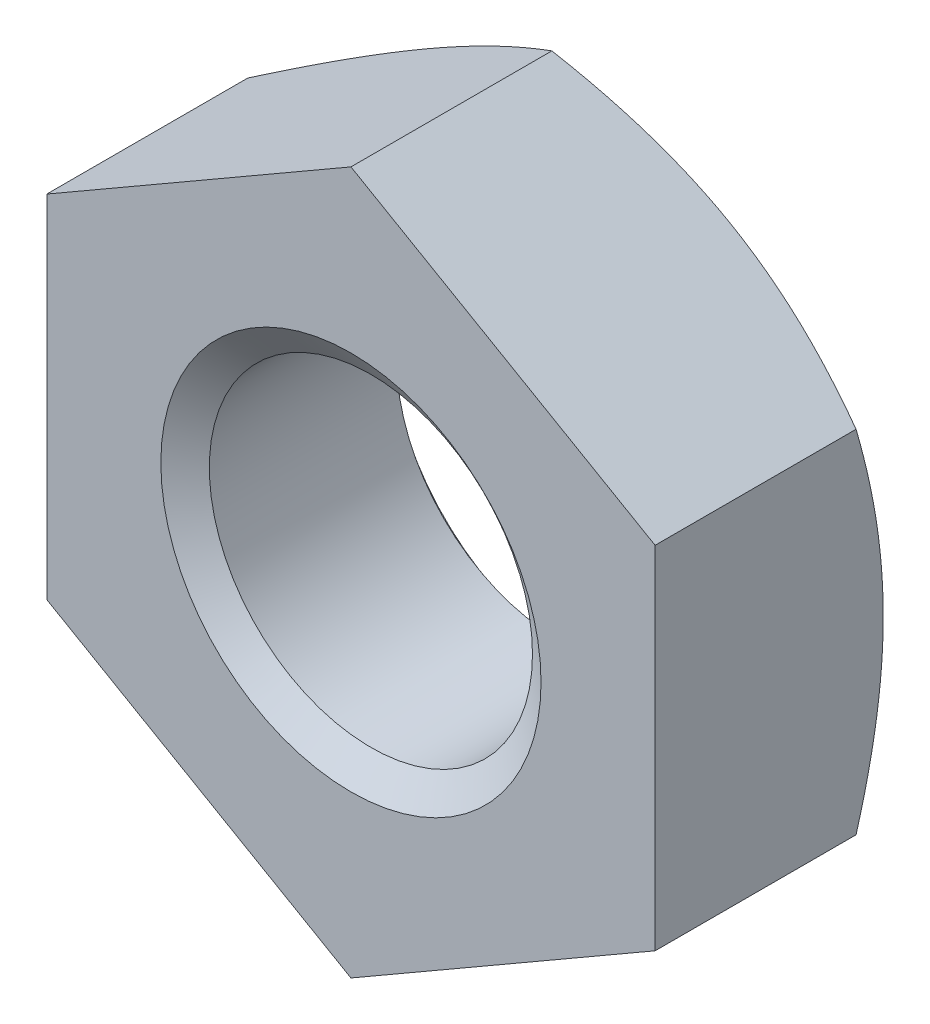
ISO-10303-21;
HEADER;
FILE_DESCRIPTION(('STEP AP214'),'2;1');
FILE_NAME('part.step','',(''),(''),'','','');
FILE_SCHEMA(('AUTOMOTIVE_DESIGN { 1 0 10303 214 1 1 1 1 }'));
ENDSEC;
DATA;
#1=APPLICATION_CONTEXT('core data for automotive mechanical design processes');
#2=APPLICATION_PROTOCOL_DEFINITION('international standard','automotive_design',2000,#1);
#3=PRODUCT_CONTEXT('',#1,'mechanical');
#4=PRODUCT('Part','Part','',(#3));
#5=PRODUCT_RELATED_PRODUCT_CATEGORY('part','',(#4));
#6=PRODUCT_DEFINITION_FORMATION('','',#4);
#7=PRODUCT_DEFINITION_CONTEXT('part definition',#1,'design');
#8=PRODUCT_DEFINITION('design','',#6,#7);
#9=PRODUCT_DEFINITION_SHAPE('','',#8);
#10=(LENGTH_UNIT() NAMED_UNIT(*) SI_UNIT(.MILLI.,.METRE.));
#11=(NAMED_UNIT(*) PLANE_ANGLE_UNIT() SI_UNIT($,.RADIAN.));
#12=(NAMED_UNIT(*) SI_UNIT($,.STERADIAN.) SOLID_ANGLE_UNIT());
#13=UNCERTAINTY_MEASURE_WITH_UNIT(LENGTH_MEASURE(1.E-05),#10,'distance_accuracy_value','');
#14=(GEOMETRIC_REPRESENTATION_CONTEXT(3) GLOBAL_UNCERTAINTY_ASSIGNED_CONTEXT((#13)) GLOBAL_UNIT_ASSIGNED_CONTEXT((#10,
#11,#12)) REPRESENTATION_CONTEXT('',''));
#15=CARTESIAN_POINT('',(0.,0.,0.));
#16=DIRECTION('',(0.,0.,1.));
#17=DIRECTION('',(1.,0.,0.));
#18=AXIS2_PLACEMENT_3D('',#15,#16,#17);
#19=CARTESIAN_POINT('',(0.,0.,-6.));
#20=DIRECTION('',(0.,0.,1.));
#21=DIRECTION('',(1.,0.,0.));
#22=AXIS2_PLACEMENT_3D('',#19,#20,#21);
#23=CYLINDRICAL_SURFACE('',#22,4.25);
#24=CARTESIAN_POINT('',(0.,0.,-0.525155653657284));
#25=DIRECTION('',(0.,0.,1.));
#26=DIRECTION('',(1.,0.,0.));
#27=AXIS2_PLACEMENT_3D('',#24,#25,#26);
#28=CIRCLE('',#27,4.25);
#29=CARTESIAN_POINT('',(4.25,0.,-0.525155653657284));
#30=VERTEX_POINT('',#29);
#31=EDGE_CURVE('E144',#30,#30,#28,.F.);
#32=ORIENTED_EDGE('',*,*,#31,.F.);
#33=EDGE_LOOP('',(#32));
#34=FACE_BOUND('',#33,.T.);
#35=CARTESIAN_POINT('',(0.,0.,-5.44944434634272));
#36=DIRECTION('',(0.,0.,-1.));
#37=DIRECTION('',(-1.,0.,0.));
#38=AXIS2_PLACEMENT_3D('',#35,#36,#37);
#39=CIRCLE('',#38,4.25);
#40=CARTESIAN_POINT('',(-4.25,0.,-5.44944434634272));
#41=VERTEX_POINT('',#40);
#42=EDGE_CURVE('E35',#41,#41,#39,.F.);
#43=ORIENTED_EDGE('',*,*,#42,.F.);
#44=EDGE_LOOP('',(#43));
#45=FACE_BOUND('',#44,.T.);
#46=ADVANCED_FACE('F30',(#34,#45),#23,.F.);
#47=CARTESIAN_POINT('',(-16.,0.,-6.));
#48=DIRECTION('',(0.,0.,1.));
#49=DIRECTION('',(1.,0.,0.));
#50=AXIS2_PLACEMENT_3D('',#47,#48,#49);
#51=PLANE('',#50);
#52=CARTESIAN_POINT('',(0.,0.,-6.));
#53=DIRECTION('',(0.,0.,1.));
#54=DIRECTION('',(1.,0.,0.));
#55=AXIS2_PLACEMENT_3D('',#52,#53,#54);
#56=CIRCLE('',#55,8.);
#57=CARTESIAN_POINT('',(8.,0.,-6.));
#58=VERTEX_POINT('',#57);
#59=CARTESIAN_POINT('',(4.,6.92820323027551,-6.));
#60=VERTEX_POINT('',#59);
#61=EDGE_CURVE('E110',#58,#60,#56,.T.);
#62=ORIENTED_EDGE('',*,*,#61,.F.);
#63=CARTESIAN_POINT('',(0.,0.,-6.));
#64=DIRECTION('',(0.,0.,1.));
#65=DIRECTION('',(1.,0.,0.));
#66=AXIS2_PLACEMENT_3D('',#63,#64,#65);
#67=CIRCLE('',#66,8.);
#68=CARTESIAN_POINT('',(4.,-6.92820323027551,-6.));
#69=VERTEX_POINT('',#68);
#70=EDGE_CURVE('E11',#58,#69,#67,.F.);
#71=ORIENTED_EDGE('',*,*,#70,.T.);
#72=CARTESIAN_POINT('',(-4.,-6.92820323027551,-6.));
#73=VERTEX_POINT('',#72);
#74=EDGE_CURVE('E40',#69,#73,#67,.F.);
#75=ORIENTED_EDGE('',*,*,#74,.T.);
#76=CARTESIAN_POINT('',(-8.,0.,-6.));
#77=VERTEX_POINT('',#76);
#78=EDGE_CURVE('E55',#73,#77,#67,.F.);
#79=ORIENTED_EDGE('',*,*,#78,.T.);
#80=CARTESIAN_POINT('',(-4.,6.92820323027551,-6.));
#81=VERTEX_POINT('',#80);
#82=EDGE_CURVE('E300',#77,#81,#67,.F.);
#83=ORIENTED_EDGE('',*,*,#82,.T.);
#84=EDGE_CURVE('E42',#81,#60,#67,.F.);
#85=ORIENTED_EDGE('',*,*,#84,.T.);
#86=EDGE_LOOP('',(#62,#71,#75,#79,#83,#85));
#87=FACE_BOUND('',#86,.T.);
#88=CARTESIAN_POINT('',(0.,0.,-6.));
#89=DIRECTION('',(0.,0.,1.));
#90=DIRECTION('',(1.,0.,0.));
#91=AXIS2_PLACEMENT_3D('',#88,#89,#90);
#92=CIRCLE('',#91,5.);
#93=CARTESIAN_POINT('',(5.,0.,-6.));
#94=VERTEX_POINT('',#93);
#95=EDGE_CURVE('E147',#94,#94,#92,.F.);
#96=ORIENTED_EDGE('',*,*,#95,.F.);
#97=EDGE_LOOP('',(#96));
#98=FACE_BOUND('',#97,.T.);
#99=ADVANCED_FACE('F234',(#87,#98),#51,.F.);
#100=CARTESIAN_POINT('',(-16.,0.,0.));
#101=DIRECTION('',(0.,0.,1.));
#102=DIRECTION('',(1.,0.,0.));
#103=AXIS2_PLACEMENT_3D('',#100,#101,#102);
#104=PLANE('',#103);
#105=DIRECTION('',(-0.866025403784439,-0.5,0.));
#106=VECTOR('',#105,1.);
#107=CARTESIAN_POINT('',(0.,9.23760430703401,0.));
#108=LINE('',#107,#106);
#109=CARTESIAN_POINT('',(0.,9.23760430703401,0.));
#110=VERTEX_POINT('',#109);
#111=CARTESIAN_POINT('',(-8.,4.618802153517,0.));
#112=VERTEX_POINT('',#111);
#113=EDGE_CURVE('E212',#110,#112,#108,.T.);
#114=ORIENTED_EDGE('',*,*,#113,.T.);
#115=DIRECTION('',(0.,-1.,0.));
#116=VECTOR('',#115,1.);
#117=CARTESIAN_POINT('',(-8.,4.618802153517,0.));
#118=LINE('',#117,#116);
#119=CARTESIAN_POINT('',(-8.,-4.61880215351701,0.));
#120=VERTEX_POINT('',#119);
#121=EDGE_CURVE('E271',#112,#120,#118,.T.);
#122=ORIENTED_EDGE('',*,*,#121,.T.);
#123=DIRECTION('',(0.866025403784439,-0.5,0.));
#124=VECTOR('',#123,1.);
#125=CARTESIAN_POINT('',(-8.,-4.61880215351701,0.));
#126=LINE('',#125,#124);
#127=CARTESIAN_POINT('',(0.,-9.23760430703402,0.));
#128=VERTEX_POINT('',#127);
#129=EDGE_CURVE('E273',#120,#128,#126,.T.);
#130=ORIENTED_EDGE('',*,*,#129,.T.);
#131=DIRECTION('',(0.866025403784439,0.5,0.));
#132=VECTOR('',#131,1.);
#133=CARTESIAN_POINT('',(0.,-9.23760430703402,0.));
#134=LINE('',#133,#132);
#135=CARTESIAN_POINT('',(8.,-4.61880215351701,0.));
#136=VERTEX_POINT('',#135);
#137=EDGE_CURVE('E289',#128,#136,#134,.T.);
#138=ORIENTED_EDGE('',*,*,#137,.T.);
#139=DIRECTION('',(0.,-1.,0.));
#140=VECTOR('',#139,1.);
#141=CARTESIAN_POINT('',(8.,4.61880215351701,0.));
#142=LINE('',#141,#140);
#143=CARTESIAN_POINT('',(8.,4.61880215351701,0.));
#144=VERTEX_POINT('',#143);
#145=EDGE_CURVE('E291',#144,#136,#142,.T.);
#146=ORIENTED_EDGE('',*,*,#145,.F.);
#147=DIRECTION('',(-0.866025403784439,0.5,0.));
#148=VECTOR('',#147,1.);
#149=CARTESIAN_POINT('',(8.,4.61880215351701,0.));
#150=LINE('',#149,#148);
#151=EDGE_CURVE('E130',#144,#110,#150,.T.);
#152=ORIENTED_EDGE('',*,*,#151,.T.);
#153=EDGE_LOOP('',(#114,#122,#130,#138,#146,#152));
#154=FACE_BOUND('',#153,.T.);
#155=CARTESIAN_POINT('',(0.,0.,0.));
#156=DIRECTION('',(0.,0.,1.));
#157=DIRECTION('',(1.,0.,0.));
#158=AXIS2_PLACEMENT_3D('',#155,#156,#157);
#159=CIRCLE('',#158,5.);
#160=CARTESIAN_POINT('',(5.,0.,0.));
#161=VERTEX_POINT('',#160);
#162=EDGE_CURVE('E146',#161,#161,#159,.T.);
#163=ORIENTED_EDGE('',*,*,#162,.F.);
#164=EDGE_LOOP('',(#163));
#165=FACE_BOUND('',#164,.T.);
#166=ADVANCED_FACE('F217',(#154,#165),#104,.T.);
#167=CARTESIAN_POINT('',(0.,9.23760430703401,-6.));
#168=DIRECTION('',(-0.5,0.866025403784438,0.));
#169=DIRECTION('',(-0.866025403784439,-0.5,0.));
#170=AXIS2_PLACEMENT_3D('',#167,#168,#169);
#171=PLANE('',#170);
#172=CARTESIAN_POINT('',(-8.0002,4.61868668346317,-5.28540215226702));
#173=CARTESIAN_POINT('',(-7.8243512161201,4.72021302617289,-5.3440092859527));
#174=CARTESIAN_POINT('',(-7.64784680569387,4.82211789504564,-5.3999565989527));
#175=CARTESIAN_POINT('',(-7.29340453712154,5.02675523421805,-5.50579899497533));
#176=CARTESIAN_POINT('',(-7.11546609530729,5.12948804149869,-5.55569146556893));
#177=CARTESIAN_POINT('',(-6.57880176237736,5.43933133858026,-5.69530720279313));
#178=CARTESIAN_POINT('',(-6.21795741776428,5.64766491807818,-5.77471882902163));
#179=CARTESIAN_POINT('',(-5.67796082979595,5.95943209350317,-5.86783835370551));
#180=CARTESIAN_POINT('',(-5.50042181035671,6.06193429416807,-5.89436541897088));
#181=CARTESIAN_POINT('',(-5.1445408870398,6.26740224104455,-5.93884682514113));
#182=CARTESIAN_POINT('',(-4.96619905550676,6.37036794548792,-5.95680192348542));
#183=CARTESIAN_POINT('',(-4.6092083151764,6.57647664551585,-5.98368435150814));
#184=CARTESIAN_POINT('',(-4.4305599863905,6.67961930623068,-5.99262192645377));
#185=CARTESIAN_POINT('',(-4.07309829490261,6.88599991003618,-6.00127769603487));
#186=CARTESIAN_POINT('',(-3.89428493746993,6.98923785008464,-6.00099617549715));
#187=CARTESIAN_POINT('',(-3.55998663298309,7.18224506616975,-5.99185497473122));
#188=CARTESIAN_POINT('',(-3.40447809566132,7.27202796205376,-5.98411039563263));
#189=CARTESIAN_POINT('',(-3.09382523825949,7.45138347289924,-5.96179886514657));
#190=CARTESIAN_POINT('',(-2.93868094344,7.54095607327651,-5.94723145386185));
#191=CARTESIAN_POINT('',(-2.47384868410518,7.80932710333149,-5.89363930947246));
#192=CARTESIAN_POINT('',(-2.16498351281828,7.98765049311728,-5.84473135833086));
#193=CARTESIAN_POINT('',(-1.5439767712397,8.34618890253624,-5.72246059676569));
#194=CARTESIAN_POINT('',(-1.23191445788552,8.52635816315521,-5.648579479624));
#195=CARTESIAN_POINT('',(-0.612443518305241,8.88400987687704,-5.48089985874503));
#196=CARTESIAN_POINT('',(-0.30502695910825,9.06149691008277,-5.38714073914554));
#197=CARTESIAN_POINT('',(0.000199999999999164,9.23771977708785,-5.28540215226702));
#198=B_SPLINE_CURVE_WITH_KNOTS('',3,(#172,#173,#174,#175,#176,#177,#178,#179,#180,#181,#182,
#183,#184,#185,#186,#187,#188,#189,#190,#191,#192,#193,#194,#195,#196,#197),.UNSPECIFIED.,.F.,
.F.,(4,2,2,2,2,2,2,2,2,2,2,2,4),(0.,0.633973543721352,1.26821965714356,2.53934712434766,
3.15934343977049,3.77928496069784,4.39852133866766,5.01773858515596,5.55680239410249,
6.09590254421148,7.17487077411835,8.27776850154293,9.37850115249055),.UNSPECIFIED.);
#199=CARTESIAN_POINT('',(-8.,4.61880215351701,-5.28546882018367));
#200=VERTEX_POINT('',#199);
#201=EDGE_CURVE('E125',#200,#81,#198,.T.);
#202=ORIENTED_EDGE('',*,*,#201,.F.);
#203=DIRECTION('',(0.,0.,1.));
#204=VECTOR('',#203,1.);
#205=CARTESIAN_POINT('',(-8.,4.618802153517,-6.));
#206=LINE('',#205,#204);
#207=EDGE_CURVE('E142',#200,#112,#206,.T.);
#208=ORIENTED_EDGE('',*,*,#207,.T.);
#209=ORIENTED_EDGE('',*,*,#113,.F.);
#210=DIRECTION('',(0.,0.,1.));
#211=VECTOR('',#210,1.);
#212=CARTESIAN_POINT('',(0.,9.23760430703401,-6.));
#213=LINE('',#212,#211);
#214=CARTESIAN_POINT('',(0.,9.23760430703401,-5.28546882018367));
#215=VERTEX_POINT('',#214);
#216=EDGE_CURVE('E131',#215,#110,#213,.T.);
#217=ORIENTED_EDGE('',*,*,#216,.F.);
#218=EDGE_CURVE('E206',#81,#215,#198,.T.);
#219=ORIENTED_EDGE('',*,*,#218,.F.);
#220=EDGE_LOOP('',(#202,#208,#209,#217,#219));
#221=FACE_BOUND('',#220,.T.);
#222=ADVANCED_FACE('F32',(#221),#171,.T.);
#223=CARTESIAN_POINT('',(8.,4.61880215351701,-6.));
#224=DIRECTION('',(0.5,0.866025403784438,0.));
#225=DIRECTION('',(-0.866025403784439,0.5,0.));
#226=AXIS2_PLACEMENT_3D('',#223,#224,#225);
#227=PLANE('',#226);
#228=CARTESIAN_POINT('',(-0.000200000000000814,9.23771977708785,-5.28540215226702));
#229=CARTESIAN_POINT('',(0.175648783879896,9.13619343437813,-5.34400928595269));
#230=CARTESIAN_POINT('',(0.352153194306134,9.03428856550538,-5.3999565989527));
#231=CARTESIAN_POINT('',(0.70659546287846,8.82965122633297,-5.50579899497533));
#232=CARTESIAN_POINT('',(0.884533904692713,8.72691841905232,-5.55569146556893));
#233=CARTESIAN_POINT('',(1.42119823762264,8.41707512197076,-5.69530720279313));
#234=CARTESIAN_POINT('',(1.78204258223572,8.20874154247284,-5.77471882902163));
#235=CARTESIAN_POINT('',(2.32203917020405,7.89697436704785,-5.86783835370551));
#236=CARTESIAN_POINT('',(2.49957818964329,7.79447216638294,-5.89436541897087));
#237=CARTESIAN_POINT('',(2.8554591129602,7.58900421950647,-5.93884682514112));
#238=CARTESIAN_POINT('',(3.03380094449324,7.4860385150631,-5.95680192348542));
#239=CARTESIAN_POINT('',(3.3907916848236,7.27992981503516,-5.98368435150814));
#240=CARTESIAN_POINT('',(3.56944001360951,7.17678715432034,-5.99262192645377));
#241=CARTESIAN_POINT('',(3.92690170509739,6.97040655051483,-6.00127769603487));
#242=CARTESIAN_POINT('',(4.10571506253007,6.86716861046637,-6.00099617549715));
#243=CARTESIAN_POINT('',(4.44001336701691,6.67416139438126,-5.99185497473122));
#244=CARTESIAN_POINT('',(4.59552190433868,6.58437849849726,-5.98411039563263));
#245=CARTESIAN_POINT('',(4.90617476174052,6.40502298765178,-5.96179886514657));
#246=CARTESIAN_POINT('',(5.06131905656,6.31545038727451,-5.94723145386185));
#247=CARTESIAN_POINT('',(5.52615131589482,6.04707935721953,-5.89363930947246));
#248=CARTESIAN_POINT('',(5.83501648718172,5.86875596743374,-5.84473135833086));
#249=CARTESIAN_POINT('',(6.4560232287603,5.51021755801478,-5.72246059676569));
#250=CARTESIAN_POINT('',(6.76808554211448,5.3300482973958,-5.648579479624));
#251=CARTESIAN_POINT('',(7.38755648169476,4.97239658367398,-5.48089985874503));
#252=CARTESIAN_POINT('',(7.69497304089175,4.79490955046824,-5.38714073914554));
#253=CARTESIAN_POINT('',(8.0002,4.61868668346317,-5.28540215226702));
#254=B_SPLINE_CURVE_WITH_KNOTS('',3,(#228,#229,#230,#231,#232,#233,#234,#235,#236,#237,#238,
#239,#240,#241,#242,#243,#244,#245,#246,#247,#248,#249,#250,#251,#252,#253),.UNSPECIFIED.,.F.,
.F.,(4,2,2,2,2,2,2,2,2,2,2,2,4),(0.,0.633973543721352,1.26821965714356,2.53934712434766,
3.15934343977049,3.77928496069784,4.39852133866767,5.01773858515596,5.5568023941025,
6.09590254421149,7.17487077411835,8.27776850154293,9.37850115249055),.UNSPECIFIED.);
#255=EDGE_CURVE('E115',#215,#60,#254,.T.);
#256=ORIENTED_EDGE('',*,*,#255,.F.);
#257=ORIENTED_EDGE('',*,*,#216,.T.);
#258=ORIENTED_EDGE('',*,*,#151,.F.);
#259=DIRECTION('',(0.,0.,1.));
#260=VECTOR('',#259,1.);
#261=CARTESIAN_POINT('',(8.,4.61880215351701,-6.));
#262=LINE('',#261,#260);
#263=CARTESIAN_POINT('',(8.,4.61880215351701,-5.28546882018367));
#264=VERTEX_POINT('',#263);
#265=EDGE_CURVE('E122',#264,#144,#262,.T.);
#266=ORIENTED_EDGE('',*,*,#265,.F.);
#267=EDGE_CURVE('E105',#60,#264,#254,.T.);
#268=ORIENTED_EDGE('',*,*,#267,.F.);
#269=EDGE_LOOP('',(#256,#257,#258,#266,#268));
#270=FACE_BOUND('',#269,.T.);
#271=ADVANCED_FACE('F128',(#270),#227,.T.);
#272=CARTESIAN_POINT('',(8.,4.61880215351701,-6.));
#273=DIRECTION('',(-1.,0.,0.));
#274=DIRECTION('',(0.,0.,1.));
#275=AXIS2_PLACEMENT_3D('',#272,#273,#274);
#276=PLANE('',#275);
#277=DIRECTION('',(0.,0.,1.));
#278=VECTOR('',#277,1.);
#279=CARTESIAN_POINT('',(8.,-4.61880215351701,-6.));
#280=LINE('',#279,#278);
#281=CARTESIAN_POINT('',(8.,-4.61880215351701,-5.28546882018367));
#282=VERTEX_POINT('',#281);
#283=EDGE_CURVE('E132',#282,#136,#280,.T.);
#284=ORIENTED_EDGE('',*,*,#283,.F.);
#285=CARTESIAN_POINT('',(8.,-12.2497439799177,-2.17178635751879));
#286=CARTESIAN_POINT('',(8.,-11.8984987351192,-2.34152745781735));
#287=CARTESIAN_POINT('',(8.,-11.5464230390782,-2.50958119206079));
#288=CARTESIAN_POINT('',(8.,-10.8401616983868,-2.84134970673028));
#289=CARTESIAN_POINT('',(8.,-10.4859757012545,-3.00506373591474));
#290=CARTESIAN_POINT('',(8.,-9.7731314280381,-3.32805107323007));
#291=CARTESIAN_POINT('',(8.,-9.41445915782844,-3.48729360758333));
#292=CARTESIAN_POINT('',(8.,-8.69416671490283,-3.79893883144996));
#293=CARTESIAN_POINT('',(8.,-8.33254669701135,-3.95134187749303));
#294=CARTESIAN_POINT('',(8.,-7.60129405984854,-4.24929869059782));
#295=CARTESIAN_POINT('',(8.,-7.23161757485957,-4.39474539924997));
#296=CARTESIAN_POINT('',(8.,-6.48790521752626,-4.67424757040317));
#297=CARTESIAN_POINT('',(8.,-6.11386886541892,-4.80830176554667));
#298=CARTESIAN_POINT('',(8.,-5.36160531585212,-5.06141638272021));
#299=CARTESIAN_POINT('',(8.,-4.9833889623205,-5.18050868146434));
#300=CARTESIAN_POINT('',(8.,-4.22159300341407,-5.39983373573667));
#301=CARTESIAN_POINT('',(8.,-3.83801513546604,-5.50007245532314));
#302=CARTESIAN_POINT('',(8.,-3.06517005833206,-5.67681673496986));
#303=CARTESIAN_POINT('',(8.,-2.67590136311894,-5.75331597577212));
#304=CARTESIAN_POINT('',(8.,-2.0885729036225,-5.84642984148509));
#305=CARTESIAN_POINT('',(8.,-1.89220175174276,-5.87386398482566));
#306=CARTESIAN_POINT('',(8.,-1.49853877384913,-5.92098081548842));
#307=CARTESIAN_POINT('',(8.,-1.30124704094027,-5.94066427020763));
#308=CARTESIAN_POINT('',(8.,-0.907261125171456,-5.97175001536058));
#309=CARTESIAN_POINT('',(8.,-0.710571016085366,-5.98320372918924));
#310=CARTESIAN_POINT('',(8.,-0.316882268583056,-5.99776943665632));
#311=CARTESIAN_POINT('',(8.,-0.119883634206719,-6.00088153862247));
#312=CARTESIAN_POINT('',(8.,0.274012171056999,-5.99868986812035));
#313=CARTESIAN_POINT('',(8.,0.470909354903384,-5.99338845754377));
#314=CARTESIAN_POINT('',(8.,0.864308658379624,-5.97450159390205));
#315=CARTESIAN_POINT('',(8.,1.06081075778878,-5.96091572714248));
#316=CARTESIAN_POINT('',(8.,1.53707134445824,-5.91823147688151));
#317=CARTESIAN_POINT('',(8.,1.81646391313849,-5.88498228456821));
#318=CARTESIAN_POINT('',(8.,2.37310809107457,-5.80358169500832));
#319=CARTESIAN_POINT('',(8.,2.65035909476179,-5.75542623022554));
#320=CARTESIAN_POINT('',(8.,3.20249141370952,-5.64592101606852));
#321=CARTESIAN_POINT('',(8.,3.47737023104611,-5.58455879141516));
#322=CARTESIAN_POINT('',(8.,4.02429975324252,-5.45051229166832));
#323=CARTESIAN_POINT('',(8.,4.2963507219513,-5.37782908316642));
#324=CARTESIAN_POINT('',(8.,4.84432510211613,-5.22097954855783));
#325=CARTESIAN_POINT('',(8.,5.12017997476412,-5.13657541783993));
#326=CARTESIAN_POINT('',(8.,5.66897392708332,-4.95942754035761));
#327=CARTESIAN_POINT('',(8.,5.94191487461248,-4.86668954576064));
#328=CARTESIAN_POINT('',(8.,6.48378576423058,-4.67478953482265));
#329=CARTESIAN_POINT('',(8.,6.75272963565232,-4.57566661531195));
#330=CARTESIAN_POINT('',(8.,7.28853074702747,-4.37160282538498));
#331=CARTESIAN_POINT('',(8.,7.55538709319939,-4.26665960355147));
#332=CARTESIAN_POINT('',(8.,7.82127397973354,-4.15938198691647));
#333=B_SPLINE_CURVE_WITH_KNOTS('',3,(#285,#286,#287,#288,#289,#290,#291,#292,#293,#294,#295,
#296,#297,#298,#299,#300,#301,#302,#303,#304,#305,#306,#307,#308,#309,#310,#311,#312,#313,#314,
#315,#316,#317,#318,#319,#320,#321,#322,#323,#324,#325,#326,#327,#328,#329,#330,#331,#332),
.UNSPECIFIED.,.F.,.F.,(4,2,2,2,2,2,2,2,2,2,2,2,2,2,2,2,2,2,2,2,2,2,2,4),(0.,1.17034358506454,
2.3408884611985,3.51813189291972,4.69531388569646,5.88694801994963,7.07871454421367,
8.2678972939517,9.45670322782927,10.6458253413567,11.2405311012284,11.8351779643657,
12.4260760875167,13.0169665369751,13.6076911374643,14.1984452389235,15.0420672118768,
15.8859195906795,16.7305726096943,17.5751460989191,18.4404219096463,19.3051050140239,
20.1649211009824,21.0250871227256),.UNSPECIFIED.);
#334=EDGE_CURVE('E124',#282,#58,#333,.T.);
#335=ORIENTED_EDGE('',*,*,#334,.T.);
#336=EDGE_CURVE('E108',#58,#264,#333,.T.);
#337=ORIENTED_EDGE('',*,*,#336,.T.);
#338=ORIENTED_EDGE('',*,*,#265,.T.);
#339=ORIENTED_EDGE('',*,*,#145,.T.);
#340=EDGE_LOOP('',(#284,#335,#337,#338,#339));
#341=FACE_BOUND('',#340,.T.);
#342=ADVANCED_FACE('F120',(#341),#276,.F.);
#343=CARTESIAN_POINT('',(0.,-9.23760430703402,-6.));
#344=DIRECTION('',(0.5,-0.866025403784438,0.));
#345=DIRECTION('',(0.866025403784439,0.5,0.));
#346=AXIS2_PLACEMENT_3D('',#343,#344,#345);
#347=PLANE('',#346);
#348=CARTESIAN_POINT('',(8.0002,-4.61868668346317,-5.28540215226702));
#349=CARTESIAN_POINT('',(7.8243512161201,-4.72021302617289,-5.3440092859527));
#350=CARTESIAN_POINT('',(7.64784680569387,-4.82211789504564,-5.3999565989527));
#351=CARTESIAN_POINT('',(7.29340453712154,-5.02675523421805,-5.50579899497533));
#352=CARTESIAN_POINT('',(7.11546609530729,-5.12948804149869,-5.55569146556893));
#353=CARTESIAN_POINT('',(6.57880176237736,-5.43933133858026,-5.69530720279313));
#354=CARTESIAN_POINT('',(6.21795741776427,-5.64766491807818,-5.77471882902163));
#355=CARTESIAN_POINT('',(5.67796082979595,-5.95943209350317,-5.86783835370551));
#356=CARTESIAN_POINT('',(5.50042181035671,-6.06193429416808,-5.89436541897087));
#357=CARTESIAN_POINT('',(5.1445408870398,-6.26740224104455,-5.93884682514112));
#358=CARTESIAN_POINT('',(4.96619905550676,-6.37036794548792,-5.95680192348542));
#359=CARTESIAN_POINT('',(4.6092083151764,-6.57647664551586,-5.98368435150813));
#360=CARTESIAN_POINT('',(4.43055998639049,-6.67961930623068,-5.99262192645377));
#361=CARTESIAN_POINT('',(4.07309829490261,-6.88599991003619,-6.00127769603487));
#362=CARTESIAN_POINT('',(3.89428493746993,-6.98923785008465,-6.00099617549715));
#363=CARTESIAN_POINT('',(3.55998663298309,-7.18224506616976,-5.99185497473122));
#364=CARTESIAN_POINT('',(3.40447809566132,-7.27202796205377,-5.98411039563263));
#365=CARTESIAN_POINT('',(3.09382523825948,-7.45138347289924,-5.96179886514657));
#366=CARTESIAN_POINT('',(2.93868094344,-7.54095607327651,-5.94723145386185));
#367=CARTESIAN_POINT('',(2.47384868410518,-7.80932710333149,-5.89363930947246));
#368=CARTESIAN_POINT('',(2.16498351281828,-7.98765049311728,-5.84473135833085));
#369=CARTESIAN_POINT('',(1.5439767712397,-8.34618890253625,-5.72246059676568));
#370=CARTESIAN_POINT('',(1.23191445788552,-8.52635816315522,-5.648579479624));
#371=CARTESIAN_POINT('',(0.612443518305241,-8.88400987687704,-5.48089985874502));
#372=CARTESIAN_POINT('',(0.305026959108249,-9.06149691008278,-5.38714073914554));
#373=CARTESIAN_POINT('',(-0.000200000000000052,-9.23771977708785,-5.28540215226702));
#374=B_SPLINE_CURVE_WITH_KNOTS('',3,(#348,#349,#350,#351,#352,#353,#354,#355,#356,#357,#358,
#359,#360,#361,#362,#363,#364,#365,#366,#367,#368,#369,#370,#371,#372,#373),.UNSPECIFIED.,.F.,
.F.,(4,2,2,2,2,2,2,2,2,2,2,2,4),(0.,0.633973543721351,1.26821965714356,2.53934712434766,
3.1593434397705,3.77928496069784,4.39852133866767,5.01773858515596,5.55680239410249,
6.09590254421148,7.17487077411835,8.27776850154293,9.37850115249055),.UNSPECIFIED.);
#375=EDGE_CURVE('E296',#282,#69,#374,.T.);
#376=ORIENTED_EDGE('',*,*,#375,.F.);
#377=ORIENTED_EDGE('',*,*,#283,.T.);
#378=ORIENTED_EDGE('',*,*,#137,.F.);
#379=DIRECTION('',(0.,0.,1.));
#380=VECTOR('',#379,1.);
#381=CARTESIAN_POINT('',(0.,-9.23760430703402,-6.));
#382=LINE('',#381,#380);
#383=CARTESIAN_POINT('',(0.,-9.23760430703401,-5.28546882018367));
#384=VERTEX_POINT('',#383);
#385=EDGE_CURVE('E135',#384,#128,#382,.T.);
#386=ORIENTED_EDGE('',*,*,#385,.F.);
#387=EDGE_CURVE('E193',#69,#384,#374,.T.);
#388=ORIENTED_EDGE('',*,*,#387,.F.);
#389=EDGE_LOOP('',(#376,#377,#378,#386,#388));
#390=FACE_BOUND('',#389,.T.);
#391=ADVANCED_FACE('F220',(#390),#347,.T.);
#392=CARTESIAN_POINT('',(-8.,-4.61880215351701,-6.));
#393=DIRECTION('',(-0.5,-0.866025403784438,0.));
#394=DIRECTION('',(0.866025403784439,-0.5,0.));
#395=AXIS2_PLACEMENT_3D('',#392,#393,#394);
#396=PLANE('',#395);
#397=CARTESIAN_POINT('',(0.00020000000000025,-9.23771977708786,-5.28540215226702));
#398=CARTESIAN_POINT('',(-0.175648783879896,-9.13619343437813,-5.34400928595269));
#399=CARTESIAN_POINT('',(-0.352153194306135,-9.03428856550538,-5.3999565989527));
#400=CARTESIAN_POINT('',(-0.70659546287846,-8.82965122633297,-5.50579899497533));
#401=CARTESIAN_POINT('',(-0.884533904692713,-8.72691841905233,-5.55569146556893));
#402=CARTESIAN_POINT('',(-1.42119823762265,-8.41707512197076,-5.69530720279313));
#403=CARTESIAN_POINT('',(-1.78204258223572,-8.20874154247285,-5.77471882902163));
#404=CARTESIAN_POINT('',(-2.32203917020405,-7.89697436704785,-5.86783835370551));
#405=CARTESIAN_POINT('',(-2.49957818964329,-7.79447216638295,-5.89436541897087));
#406=CARTESIAN_POINT('',(-2.8554591129602,-7.58900421950647,-5.93884682514112));
#407=CARTESIAN_POINT('',(-3.03380094449324,-7.4860385150631,-5.95680192348542));
#408=CARTESIAN_POINT('',(-3.3907916848236,-7.27992981503517,-5.98368435150813));
#409=CARTESIAN_POINT('',(-3.56944001360951,-7.17678715432035,-5.99262192645377));
#410=CARTESIAN_POINT('',(-3.92690170509739,-6.97040655051484,-6.00127769603487));
#411=CARTESIAN_POINT('',(-4.10571506253007,-6.86716861046638,-6.00099617549715));
#412=CARTESIAN_POINT('',(-4.44001336701691,-6.67416139438127,-5.99185497473122));
#413=CARTESIAN_POINT('',(-4.59552190433868,-6.58437849849726,-5.98411039563263));
#414=CARTESIAN_POINT('',(-4.90617476174052,-6.40502298765178,-5.96179886514657));
#415=CARTESIAN_POINT('',(-5.06131905656,-6.31545038727451,-5.94723145386185));
#416=CARTESIAN_POINT('',(-5.52615131589482,-6.04707935721954,-5.89363930947246));
#417=CARTESIAN_POINT('',(-5.83501648718172,-5.86875596743374,-5.84473135833086));
#418=CARTESIAN_POINT('',(-6.4560232287603,-5.51021755801478,-5.72246059676568));
#419=CARTESIAN_POINT('',(-6.76808554211448,-5.33004829739581,-5.648579479624));
#420=CARTESIAN_POINT('',(-7.38755648169476,-4.97239658367398,-5.48089985874502));
#421=CARTESIAN_POINT('',(-7.69497304089175,-4.79490955046825,-5.38714073914554));
#422=CARTESIAN_POINT('',(-8.0002,-4.61868668346317,-5.28540215226702));
#423=B_SPLINE_CURVE_WITH_KNOTS('',3,(#397,#398,#399,#400,#401,#402,#403,#404,#405,#406,#407,
#408,#409,#410,#411,#412,#413,#414,#415,#416,#417,#418,#419,#420,#421,#422),.UNSPECIFIED.,.F.,
.F.,(4,2,2,2,2,2,2,2,2,2,2,2,4),(0.,0.633973543721353,1.26821965714356,2.53934712434766,
3.15934343977049,3.77928496069784,4.39852133866767,5.01773858515596,5.55680239410249,
6.09590254421148,7.17487077411835,8.27776850154293,9.37850115249055),.UNSPECIFIED.);
#424=EDGE_CURVE('E298',#384,#73,#423,.T.);
#425=ORIENTED_EDGE('',*,*,#424,.F.);
#426=ORIENTED_EDGE('',*,*,#385,.T.);
#427=ORIENTED_EDGE('',*,*,#129,.F.);
#428=DIRECTION('',(0.,0.,1.));
#429=VECTOR('',#428,1.);
#430=CARTESIAN_POINT('',(-8.,-4.61880215351701,-6.));
#431=LINE('',#430,#429);
#432=CARTESIAN_POINT('',(-8.,-4.61880215351701,-5.28546882018367));
#433=VERTEX_POINT('',#432);
#434=EDGE_CURVE('E140',#433,#120,#431,.T.);
#435=ORIENTED_EDGE('',*,*,#434,.F.);
#436=EDGE_CURVE('E168',#73,#433,#423,.T.);
#437=ORIENTED_EDGE('',*,*,#436,.F.);
#438=EDGE_LOOP('',(#425,#426,#427,#435,#437));
#439=FACE_BOUND('',#438,.T.);
#440=ADVANCED_FACE('F223',(#439),#396,.T.);
#441=CARTESIAN_POINT('',(-8.,4.618802153517,-6.));
#442=DIRECTION('',(-1.,0.,0.));
#443=DIRECTION('',(0.,0.,1.));
#444=AXIS2_PLACEMENT_3D('',#441,#442,#443);
#445=PLANE('',#444);
#446=CARTESIAN_POINT('',(-8.,-12.2497439799177,-2.17178635751879));
#447=CARTESIAN_POINT('',(-8.,-11.8984987351192,-2.34152745781735));
#448=CARTESIAN_POINT('',(-8.,-11.5464230390782,-2.50958119206078));
#449=CARTESIAN_POINT('',(-8.,-10.8401616983868,-2.84134970673028));
#450=CARTESIAN_POINT('',(-8.,-10.4859757012545,-3.00506373591474));
#451=CARTESIAN_POINT('',(-8.,-9.7731314280381,-3.32805107323007));
#452=CARTESIAN_POINT('',(-8.,-9.41445915782844,-3.48729360758333));
#453=CARTESIAN_POINT('',(-8.,-8.69416671490284,-3.79893883144995));
#454=CARTESIAN_POINT('',(-8.,-8.33254669701135,-3.95134187749303));
#455=CARTESIAN_POINT('',(-8.,-7.60129405984854,-4.24929869059782));
#456=CARTESIAN_POINT('',(-8.,-7.23161757485957,-4.39474539924997));
#457=CARTESIAN_POINT('',(-8.,-6.48790521752626,-4.67424757040317));
#458=CARTESIAN_POINT('',(-8.,-6.11386886541892,-4.80830176554667));
#459=CARTESIAN_POINT('',(-8.,-5.36160531585212,-5.06141638272021));
#460=CARTESIAN_POINT('',(-8.,-4.9833889623205,-5.18050868146434));
#461=CARTESIAN_POINT('',(-8.,-4.22159300341407,-5.39983373573667));
#462=CARTESIAN_POINT('',(-8.,-3.83801513546604,-5.50007245532314));
#463=CARTESIAN_POINT('',(-8.,-3.06517005833206,-5.67681673496986));
#464=CARTESIAN_POINT('',(-8.,-2.67590136311894,-5.75331597577212));
#465=CARTESIAN_POINT('',(-8.,-2.0885729036225,-5.84642984148509));
#466=CARTESIAN_POINT('',(-8.,-1.89220175174276,-5.87386398482566));
#467=CARTESIAN_POINT('',(-8.,-1.49853877384913,-5.92098081548842));
#468=CARTESIAN_POINT('',(-8.,-1.30124704094027,-5.94066427020763));
#469=CARTESIAN_POINT('',(-8.,-0.907261125171456,-5.97175001536058));
#470=CARTESIAN_POINT('',(-8.,-0.710571016085367,-5.98320372918924));
#471=CARTESIAN_POINT('',(-8.,-0.316882268583056,-5.99776943665632));
#472=CARTESIAN_POINT('',(-8.,-0.11988363420672,-6.00088153862247));
#473=CARTESIAN_POINT('',(-8.,0.274012171056998,-5.99868986812035));
#474=CARTESIAN_POINT('',(-8.,0.470909354903384,-5.99338845754377));
#475=CARTESIAN_POINT('',(-8.,0.864308658379623,-5.97450159390205));
#476=CARTESIAN_POINT('',(-8.,1.06081075778878,-5.96091572714248));
#477=CARTESIAN_POINT('',(-8.,1.53707134445824,-5.91823147688151));
#478=CARTESIAN_POINT('',(-8.,1.81646391313849,-5.88498228456821));
#479=CARTESIAN_POINT('',(-8.,2.37310809107457,-5.80358169500832));
#480=CARTESIAN_POINT('',(-8.,2.65035909476178,-5.75542623022555));
#481=CARTESIAN_POINT('',(-8.,3.20249141370951,-5.64592101606852));
#482=CARTESIAN_POINT('',(-8.,3.47737023104611,-5.58455879141516));
#483=CARTESIAN_POINT('',(-8.,4.02429975324251,-5.45051229166832));
#484=CARTESIAN_POINT('',(-8.,4.29635072195129,-5.37782908316642));
#485=CARTESIAN_POINT('',(-8.,4.84432510211613,-5.22097954855783));
#486=CARTESIAN_POINT('',(-8.,5.12017997476411,-5.13657541783993));
#487=CARTESIAN_POINT('',(-8.,5.66897392708332,-4.95942754035761));
#488=CARTESIAN_POINT('',(-8.,5.94191487461248,-4.86668954576064));
#489=CARTESIAN_POINT('',(-8.,6.48378576423058,-4.67478953482265));
#490=CARTESIAN_POINT('',(-8.,6.75272963565232,-4.57566661531195));
#491=CARTESIAN_POINT('',(-8.,7.28853074702747,-4.37160282538499));
#492=CARTESIAN_POINT('',(-8.,7.55538709319939,-4.26665960355147));
#493=CARTESIAN_POINT('',(-8.,7.82127397973354,-4.15938198691647));
#494=B_SPLINE_CURVE_WITH_KNOTS('',3,(#446,#447,#448,#449,#450,#451,#452,#453,#454,#455,#456,
#457,#458,#459,#460,#461,#462,#463,#464,#465,#466,#467,#468,#469,#470,#471,#472,#473,#474,#475,
#476,#477,#478,#479,#480,#481,#482,#483,#484,#485,#486,#487,#488,#489,#490,#491,#492,#493),
.UNSPECIFIED.,.F.,.F.,(4,2,2,2,2,2,2,2,2,2,2,2,2,2,2,2,2,2,2,2,2,2,2,4),(0.,1.17034358506454,
2.3408884611985,3.51813189291972,4.69531388569646,5.88694801994963,7.07871454421367,
8.2678972939517,9.45670322782928,10.6458253413567,11.2405311012284,11.8351779643657,
12.4260760875167,13.0169665369752,13.6076911374643,14.1984452389235,15.0420672118768,
15.8859195906795,16.7305726096943,17.5751460989191,18.4404219096463,19.3051050140239,
20.1649211009824,21.0250871227256),.UNSPECIFIED.);
#495=EDGE_CURVE('E167',#433,#77,#494,.T.);
#496=ORIENTED_EDGE('',*,*,#495,.F.);
#497=ORIENTED_EDGE('',*,*,#434,.T.);
#498=ORIENTED_EDGE('',*,*,#121,.F.);
#499=ORIENTED_EDGE('',*,*,#207,.F.);
#500=EDGE_CURVE('E161',#77,#200,#494,.T.);
#501=ORIENTED_EDGE('',*,*,#500,.F.);
#502=EDGE_LOOP('',(#496,#497,#498,#499,#501));
#503=FACE_BOUND('',#502,.T.);
#504=ADVANCED_FACE('F174',(#503),#445,.T.);
#505=CARTESIAN_POINT('',(0.,0.,-6.));
#506=DIRECTION('',(0.,0.,1.));
#507=DIRECTION('',(1.,0.,0.));
#508=AXIS2_PLACEMENT_3D('',#505,#506,#507);
#509=CONICAL_SURFACE('',#508,8.,1.0471975511966);
#510=ORIENTED_EDGE('',*,*,#267,.T.);
#511=ORIENTED_EDGE('',*,*,#336,.F.);
#512=ORIENTED_EDGE('',*,*,#61,.T.);
#513=EDGE_LOOP('',(#510,#511,#512));
#514=FACE_BOUND('',#513,.T.);
#515=ADVANCED_FACE('F107',(#514),#509,.T.);
#516=ORIENTED_EDGE('',*,*,#218,.T.);
#517=ORIENTED_EDGE('',*,*,#255,.T.);
#518=ORIENTED_EDGE('',*,*,#84,.F.);
#519=EDGE_LOOP('',(#516,#517,#518));
#520=FACE_BOUND('',#519,.T.);
#521=ADVANCED_FACE('F184',(#520),#509,.T.);
#522=ORIENTED_EDGE('',*,*,#201,.T.);
#523=ORIENTED_EDGE('',*,*,#82,.F.);
#524=ORIENTED_EDGE('',*,*,#500,.T.);
#525=EDGE_LOOP('',(#522,#523,#524));
#526=FACE_BOUND('',#525,.T.);
#527=ADVANCED_FACE('F182',(#526),#509,.T.);
#528=ORIENTED_EDGE('',*,*,#436,.T.);
#529=ORIENTED_EDGE('',*,*,#495,.T.);
#530=ORIENTED_EDGE('',*,*,#78,.F.);
#531=EDGE_LOOP('',(#528,#529,#530));
#532=FACE_BOUND('',#531,.T.);
#533=ADVANCED_FACE('F176',(#532),#509,.T.);
#534=ORIENTED_EDGE('',*,*,#387,.T.);
#535=ORIENTED_EDGE('',*,*,#424,.T.);
#536=ORIENTED_EDGE('',*,*,#74,.F.);
#537=EDGE_LOOP('',(#534,#535,#536));
#538=FACE_BOUND('',#537,.T.);
#539=ADVANCED_FACE('F181',(#538),#509,.T.);
#540=ORIENTED_EDGE('',*,*,#375,.T.);
#541=ORIENTED_EDGE('',*,*,#70,.F.);
#542=ORIENTED_EDGE('',*,*,#334,.F.);
#543=EDGE_LOOP('',(#540,#541,#542));
#544=FACE_BOUND('',#543,.T.);
#545=ADVANCED_FACE('F252',(#544),#509,.T.);
#546=CARTESIAN_POINT('',(0.,0.,-0.577671219023013));
#547=DIRECTION('',(0.,0.,1.));
#548=DIRECTION('',(1.,0.,0.));
#549=AXIS2_PLACEMENT_3D('',#546,#547,#548);
#550=CONICAL_SURFACE('',#549,4.175,0.95993108859688);
#551=ORIENTED_EDGE('',*,*,#162,.T.);
#552=EDGE_LOOP('',(#551));
#553=FACE_BOUND('',#552,.T.);
#554=ORIENTED_EDGE('',*,*,#31,.T.);
#555=EDGE_LOOP('',(#554));
#556=FACE_BOUND('',#555,.T.);
#557=ADVANCED_FACE('F185',(#553,#556),#550,.F.);
#558=CARTESIAN_POINT('',(0.,0.,-5.9746));
#559=DIRECTION('',(0.,0.,-1.));
#560=DIRECTION('',(-1.,0.,0.));
#561=AXIS2_PLACEMENT_3D('',#558,#559,#560);
#562=CONICAL_SURFACE('',#561,5.,0.95993108859688);
#563=CARTESIAN_POINT('',(0.,0.,-5.9746));
#564=DIRECTION('',(0.,0.,1.));
#565=DIRECTION('',(1.,0.,0.));
#566=AXIS2_PLACEMENT_3D('',#563,#564,#565);
#567=CIRCLE('',#566,5.);
#568=CARTESIAN_POINT('',(5.,0.,-5.9746));
#569=VERTEX_POINT('',#568);
#570=EDGE_CURVE('E149',#569,#569,#567,.T.);
#571=ORIENTED_EDGE('',*,*,#570,.F.);
#572=EDGE_LOOP('',(#571));
#573=FACE_BOUND('',#572,.T.);
#574=ORIENTED_EDGE('',*,*,#42,.T.);
#575=EDGE_LOOP('',(#574));
#576=FACE_BOUND('',#575,.T.);
#577=ADVANCED_FACE('F243',(#573,#576),#562,.F.);
#578=CARTESIAN_POINT('',(0.,0.,-25.0375057290932));
#579=DIRECTION('',(0.,0.,1.));
#580=DIRECTION('',(1.,0.,0.));
#581=AXIS2_PLACEMENT_3D('',#578,#579,#580);
#582=CYLINDRICAL_SURFACE('',#581,5.);
#583=ORIENTED_EDGE('',*,*,#570,.T.);
#584=EDGE_LOOP('',(#583));
#585=FACE_BOUND('',#584,.T.);
#586=ORIENTED_EDGE('',*,*,#95,.T.);
#587=EDGE_LOOP('',(#586));
#588=FACE_BOUND('',#587,.T.);
#589=ADVANCED_FACE('F245',(#585,#588),#582,.F.);
#590=CLOSED_SHELL('',(#46,#99,#166,#222,#271,#342,#391,#440,#504,#515,#521,#527,#533,#539,#545,
#557,#577,#589));
#591=MANIFOLD_SOLID_BREP('B2',#590);
#592=ADVANCED_BREP_SHAPE_REPRESENTATION('',(#18,#591),#14);
#593=SHAPE_DEFINITION_REPRESENTATION(#9,#592);
ENDSEC;
END-ISO-10303-21;
